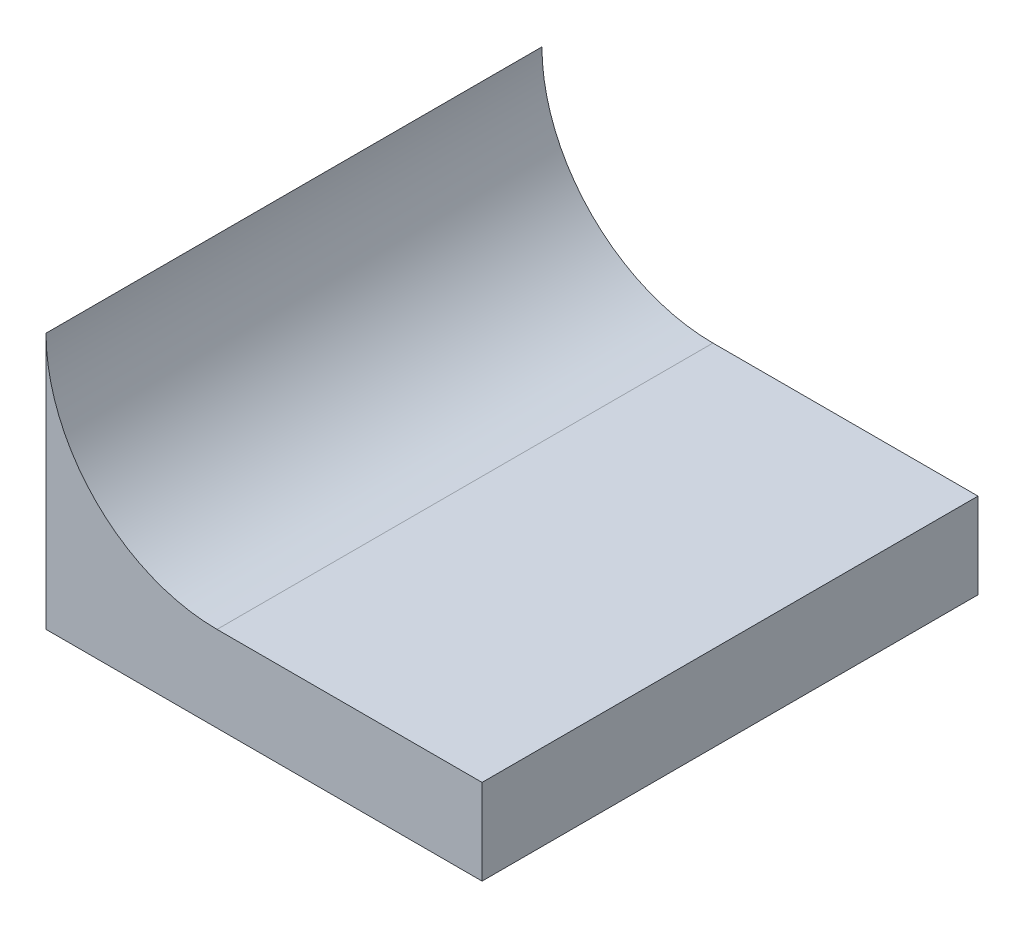
ISO-10303-21;
HEADER;
FILE_DESCRIPTION(('STEP AP214'),'2;1');
FILE_NAME('part.step','',(''),(''),'','','');
FILE_SCHEMA(('AUTOMOTIVE_DESIGN { 1 0 10303 214 1 1 1 1 }'));
ENDSEC;
DATA;
#1=APPLICATION_CONTEXT('core data for automotive mechanical design processes');
#2=APPLICATION_PROTOCOL_DEFINITION('international standard','automotive_design',2000,#1);
#3=PRODUCT_CONTEXT('',#1,'mechanical');
#4=PRODUCT('Part','Part','',(#3));
#5=PRODUCT_RELATED_PRODUCT_CATEGORY('part','',(#4));
#6=PRODUCT_DEFINITION_FORMATION('','',#4);
#7=PRODUCT_DEFINITION_CONTEXT('part definition',#1,'design');
#8=PRODUCT_DEFINITION('design','',#6,#7);
#9=PRODUCT_DEFINITION_SHAPE('','',#8);
#10=(LENGTH_UNIT() NAMED_UNIT(*) SI_UNIT(.MILLI.,.METRE.));
#11=(NAMED_UNIT(*) PLANE_ANGLE_UNIT() SI_UNIT($,.RADIAN.));
#12=(NAMED_UNIT(*) SI_UNIT($,.STERADIAN.) SOLID_ANGLE_UNIT());
#13=UNCERTAINTY_MEASURE_WITH_UNIT(LENGTH_MEASURE(1.E-05),#10,'distance_accuracy_value','');
#14=(GEOMETRIC_REPRESENTATION_CONTEXT(3) GLOBAL_UNCERTAINTY_ASSIGNED_CONTEXT((#13)) GLOBAL_UNIT_ASSIGNED_CONTEXT((#10,
#11,#12)) REPRESENTATION_CONTEXT('',''));
#15=CARTESIAN_POINT('',(0.,0.,0.));
#16=DIRECTION('',(0.,0.,1.));
#17=DIRECTION('',(1.,0.,0.));
#18=AXIS2_PLACEMENT_3D('',#15,#16,#17);
#19=CARTESIAN_POINT('',(0.,0.3,0.29));
#20=DIRECTION('',(1.,0.,0.));
#21=DIRECTION('',(0.,0.,-1.));
#22=AXIS2_PLACEMENT_3D('',#19,#20,#21);
#23=PLANE('',#22);
#24=DIRECTION('',(0.,-1.,0.));
#25=VECTOR('',#24,1.);
#26=CARTESIAN_POINT('',(0.,0.3,-0.29));
#27=LINE('',#26,#25);
#28=CARTESIAN_POINT('',(0.,0.3,-0.29));
#29=VERTEX_POINT('',#28);
#30=CARTESIAN_POINT('',(0.,0.,-0.29));
#31=VERTEX_POINT('',#30);
#32=EDGE_CURVE('E106',#29,#31,#27,.T.);
#33=ORIENTED_EDGE('',*,*,#32,.T.);
#34=DIRECTION('',(0.,0.,-1.));
#35=VECTOR('',#34,1.);
#36=CARTESIAN_POINT('',(0.,0.,0.29));
#37=LINE('',#36,#35);
#38=CARTESIAN_POINT('',(0.,0.,0.29));
#39=VERTEX_POINT('',#38);
#40=EDGE_CURVE('E11',#39,#31,#37,.T.);
#41=ORIENTED_EDGE('',*,*,#40,.F.);
#42=DIRECTION('',(0.,-1.,0.));
#43=VECTOR('',#42,1.);
#44=CARTESIAN_POINT('',(0.,0.3,0.29));
#45=LINE('',#44,#43);
#46=CARTESIAN_POINT('',(0.,0.3,0.29));
#47=VERTEX_POINT('',#46);
#48=EDGE_CURVE('E114',#47,#39,#45,.T.);
#49=ORIENTED_EDGE('',*,*,#48,.F.);
#50=DIRECTION('',(0.,0.,-1.));
#51=VECTOR('',#50,1.);
#52=CARTESIAN_POINT('',(0.,0.3,0.29));
#53=LINE('',#52,#51);
#54=EDGE_CURVE('E102',#47,#29,#53,.T.);
#55=ORIENTED_EDGE('',*,*,#54,.T.);
#56=EDGE_LOOP('',(#33,#41,#49,#55));
#57=FACE_BOUND('',#56,.T.);
#58=ADVANCED_FACE('F32',(#57),#23,.F.);
#59=CARTESIAN_POINT('',(0.,0.,0.29));
#60=DIRECTION('',(0.,1.,0.));
#61=DIRECTION('',(0.,0.,1.));
#62=AXIS2_PLACEMENT_3D('',#59,#60,#61);
#63=PLANE('',#62);
#64=DIRECTION('',(1.,0.,0.));
#65=VECTOR('',#64,1.);
#66=CARTESIAN_POINT('',(0.,0.,-0.29));
#67=LINE('',#66,#65);
#68=CARTESIAN_POINT('',(0.51,0.,-0.29));
#69=VERTEX_POINT('',#68);
#70=EDGE_CURVE('E109',#31,#69,#67,.T.);
#71=ORIENTED_EDGE('',*,*,#70,.T.);
#72=DIRECTION('',(0.,0.,-1.));
#73=VECTOR('',#72,1.);
#74=CARTESIAN_POINT('',(0.51,0.,0.29));
#75=LINE('',#74,#73);
#76=CARTESIAN_POINT('',(0.51,0.,0.29));
#77=VERTEX_POINT('',#76);
#78=EDGE_CURVE('E40',#77,#69,#75,.T.);
#79=ORIENTED_EDGE('',*,*,#78,.F.);
#80=DIRECTION('',(1.,0.,0.));
#81=VECTOR('',#80,1.);
#82=CARTESIAN_POINT('',(0.,0.,0.29));
#83=LINE('',#82,#81);
#84=EDGE_CURVE('E82',#39,#77,#83,.T.);
#85=ORIENTED_EDGE('',*,*,#84,.F.);
#86=ORIENTED_EDGE('',*,*,#40,.T.);
#87=EDGE_LOOP('',(#71,#79,#85,#86));
#88=FACE_BOUND('',#87,.T.);
#89=ADVANCED_FACE('F133',(#88),#63,.F.);
#90=CARTESIAN_POINT('',(0.51,0.,0.29));
#91=DIRECTION('',(-1.,0.,0.));
#92=DIRECTION('',(0.,0.,1.));
#93=AXIS2_PLACEMENT_3D('',#90,#91,#92);
#94=PLANE('',#93);
#95=DIRECTION('',(0.,1.,0.));
#96=VECTOR('',#95,1.);
#97=CARTESIAN_POINT('',(0.51,0.,-0.29));
#98=LINE('',#97,#96);
#99=CARTESIAN_POINT('',(0.51,0.1,-0.29));
#100=VERTEX_POINT('',#99);
#101=EDGE_CURVE('E97',#69,#100,#98,.T.);
#102=ORIENTED_EDGE('',*,*,#101,.T.);
#103=DIRECTION('',(0.,0.,-1.));
#104=VECTOR('',#103,1.);
#105=CARTESIAN_POINT('',(0.51,0.1,0.29));
#106=LINE('',#105,#104);
#107=CARTESIAN_POINT('',(0.51,0.1,0.29));
#108=VERTEX_POINT('',#107);
#109=EDGE_CURVE('E94',#108,#100,#106,.T.);
#110=ORIENTED_EDGE('',*,*,#109,.F.);
#111=DIRECTION('',(0.,1.,0.));
#112=VECTOR('',#111,1.);
#113=CARTESIAN_POINT('',(0.51,0.,0.29));
#114=LINE('',#113,#112);
#115=EDGE_CURVE('E86',#77,#108,#114,.T.);
#116=ORIENTED_EDGE('',*,*,#115,.F.);
#117=ORIENTED_EDGE('',*,*,#78,.T.);
#118=EDGE_LOOP('',(#102,#110,#116,#117));
#119=FACE_BOUND('',#118,.T.);
#120=ADVANCED_FACE('F95',(#119),#94,.F.);
#121=CARTESIAN_POINT('',(0.51,0.1,0.29));
#122=DIRECTION('',(0.,-1.,0.));
#123=DIRECTION('',(1.,0.,0.));
#124=AXIS2_PLACEMENT_3D('',#121,#122,#123);
#125=PLANE('',#124);
#126=DIRECTION('',(-1.,0.,0.));
#127=VECTOR('',#126,1.);
#128=CARTESIAN_POINT('',(0.51,0.1,-0.29));
#129=LINE('',#128,#127);
#130=CARTESIAN_POINT('',(0.2,0.0999999999999999,-0.29));
#131=VERTEX_POINT('',#130);
#132=EDGE_CURVE('E68',#100,#131,#129,.T.);
#133=ORIENTED_EDGE('',*,*,#132,.T.);
#134=DIRECTION('',(0.,0.,-1.));
#135=VECTOR('',#134,1.);
#136=CARTESIAN_POINT('',(0.2,0.0999999999999999,0.29));
#137=LINE('',#136,#135);
#138=CARTESIAN_POINT('',(0.2,0.0999999999999999,0.29));
#139=VERTEX_POINT('',#138);
#140=EDGE_CURVE('E98',#139,#131,#137,.T.);
#141=ORIENTED_EDGE('',*,*,#140,.F.);
#142=DIRECTION('',(-1.,0.,0.));
#143=VECTOR('',#142,1.);
#144=CARTESIAN_POINT('',(0.51,0.1,0.29));
#145=LINE('',#144,#143);
#146=EDGE_CURVE('E90',#108,#139,#145,.T.);
#147=ORIENTED_EDGE('',*,*,#146,.F.);
#148=ORIENTED_EDGE('',*,*,#109,.T.);
#149=EDGE_LOOP('',(#133,#141,#147,#148));
#150=FACE_BOUND('',#149,.T.);
#151=ADVANCED_FACE('F100',(#150),#125,.F.);
#152=CARTESIAN_POINT('',(0.2,0.3,0.29));
#153=DIRECTION('',(0.,0.,-1.));
#154=DIRECTION('',(-1.,0.,0.));
#155=AXIS2_PLACEMENT_3D('',#152,#153,#154);
#156=CYLINDRICAL_SURFACE('',#155,0.2);
#157=CARTESIAN_POINT('',(0.2,0.3,-0.29));
#158=DIRECTION('',(0.,0.,-1.));
#159=DIRECTION('',(1.,0.,0.));
#160=AXIS2_PLACEMENT_3D('',#157,#158,#159);
#161=CIRCLE('',#160,0.2);
#162=EDGE_CURVE('E74',#131,#29,#161,.T.);
#163=ORIENTED_EDGE('',*,*,#162,.T.);
#164=ORIENTED_EDGE('',*,*,#54,.F.);
#165=CARTESIAN_POINT('',(0.2,0.3,0.29));
#166=DIRECTION('',(0.,0.,-1.));
#167=DIRECTION('',(1.,0.,0.));
#168=AXIS2_PLACEMENT_3D('',#165,#166,#167);
#169=CIRCLE('',#168,0.2);
#170=EDGE_CURVE('E48',#139,#47,#169,.T.);
#171=ORIENTED_EDGE('',*,*,#170,.F.);
#172=ORIENTED_EDGE('',*,*,#140,.T.);
#173=EDGE_LOOP('',(#163,#164,#171,#172));
#174=FACE_BOUND('',#173,.T.);
#175=ADVANCED_FACE('F122',(#174),#156,.F.);
#176=CARTESIAN_POINT('',(0.2,0.3,0.29));
#177=DIRECTION('',(0.,0.,1.));
#178=DIRECTION('',(1.,0.,0.));
#179=AXIS2_PLACEMENT_3D('',#176,#177,#178);
#180=PLANE('',#179);
#181=ORIENTED_EDGE('',*,*,#48,.T.);
#182=ORIENTED_EDGE('',*,*,#84,.T.);
#183=ORIENTED_EDGE('',*,*,#115,.T.);
#184=ORIENTED_EDGE('',*,*,#146,.T.);
#185=ORIENTED_EDGE('',*,*,#170,.T.);
#186=EDGE_LOOP('',(#181,#182,#183,#184,#185));
#187=FACE_BOUND('',#186,.T.);
#188=ADVANCED_FACE('F88',(#187),#180,.T.);
#189=CARTESIAN_POINT('',(0.2,0.3,-0.29));
#190=DIRECTION('',(0.,0.,1.));
#191=DIRECTION('',(1.,0.,0.));
#192=AXIS2_PLACEMENT_3D('',#189,#190,#191);
#193=PLANE('',#192);
#194=ORIENTED_EDGE('',*,*,#32,.F.);
#195=ORIENTED_EDGE('',*,*,#162,.F.);
#196=ORIENTED_EDGE('',*,*,#132,.F.);
#197=ORIENTED_EDGE('',*,*,#101,.F.);
#198=ORIENTED_EDGE('',*,*,#70,.F.);
#199=EDGE_LOOP('',(#194,#195,#196,#197,#198));
#200=FACE_BOUND('',#199,.T.);
#201=ADVANCED_FACE('F118',(#200),#193,.F.);
#202=CLOSED_SHELL('',(#58,#89,#120,#151,#175,#188,#201));
#203=MANIFOLD_SOLID_BREP('B2',#202);
#204=ADVANCED_BREP_SHAPE_REPRESENTATION('',(#18,#203),#14);
#205=SHAPE_DEFINITION_REPRESENTATION(#9,#204);
ENDSEC;
END-ISO-10303-21;
